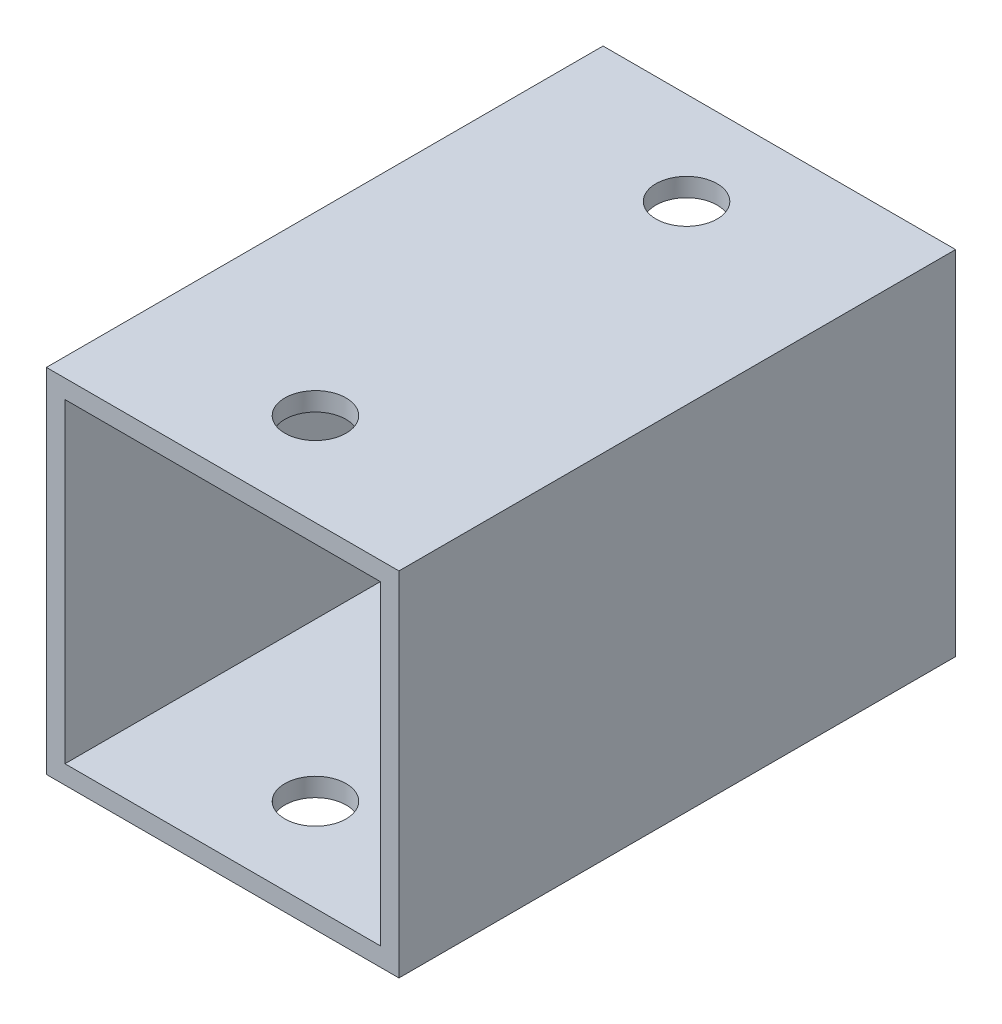
ISO-10303-21;
HEADER;
FILE_DESCRIPTION(('STEP AP214'),'2;1');
FILE_NAME('part.step','',(''),(''),'','','');
FILE_SCHEMA(('AUTOMOTIVE_DESIGN { 1 0 10303 214 1 1 1 1 }'));
ENDSEC;
DATA;
#1=APPLICATION_CONTEXT('core data for automotive mechanical design processes');
#2=APPLICATION_PROTOCOL_DEFINITION('international standard','automotive_design',2000,#1);
#3=PRODUCT_CONTEXT('',#1,'mechanical');
#4=PRODUCT('Part','Part','',(#3));
#5=PRODUCT_RELATED_PRODUCT_CATEGORY('part','',(#4));
#6=PRODUCT_DEFINITION_FORMATION('','',#4);
#7=PRODUCT_DEFINITION_CONTEXT('part definition',#1,'design');
#8=PRODUCT_DEFINITION('design','',#6,#7);
#9=PRODUCT_DEFINITION_SHAPE('','',#8);
#10=(LENGTH_UNIT() NAMED_UNIT(*) SI_UNIT(.MILLI.,.METRE.));
#11=(NAMED_UNIT(*) PLANE_ANGLE_UNIT() SI_UNIT($,.RADIAN.));
#12=(NAMED_UNIT(*) SI_UNIT($,.STERADIAN.) SOLID_ANGLE_UNIT());
#13=UNCERTAINTY_MEASURE_WITH_UNIT(LENGTH_MEASURE(1.E-05),#10,'distance_accuracy_value','');
#14=(GEOMETRIC_REPRESENTATION_CONTEXT(3) GLOBAL_UNCERTAINTY_ASSIGNED_CONTEXT((#13)) GLOBAL_UNIT_ASSIGNED_CONTEXT((#10,
#11,#12)) REPRESENTATION_CONTEXT('',''));
#15=CARTESIAN_POINT('',(0.,0.,0.));
#16=DIRECTION('',(0.,0.,1.));
#17=DIRECTION('',(1.,0.,0.));
#18=AXIS2_PLACEMENT_3D('',#15,#16,#17);
#19=CARTESIAN_POINT('',(0.,0.,30.));
#20=DIRECTION('',(0.,0.,-1.));
#21=DIRECTION('',(-1.,0.,0.));
#22=AXIS2_PLACEMENT_3D('',#19,#20,#21);
#23=PLANE('',#22);
#24=DIRECTION('',(0.,-1.,0.));
#25=VECTOR('',#24,1.);
#26=CARTESIAN_POINT('',(0.,0.,30.));
#27=LINE('',#26,#25);
#28=CARTESIAN_POINT('',(0.,19.,30.));
#29=VERTEX_POINT('',#28);
#30=CARTESIAN_POINT('',(0.,0.,30.));
#31=VERTEX_POINT('',#30);
#32=EDGE_CURVE('E132',#29,#31,#27,.T.);
#33=ORIENTED_EDGE('',*,*,#32,.T.);
#34=DIRECTION('',(1.,0.,0.));
#35=VECTOR('',#34,1.);
#36=CARTESIAN_POINT('',(0.,0.,30.));
#37=LINE('',#36,#35);
#38=CARTESIAN_POINT('',(19.,0.,30.));
#39=VERTEX_POINT('',#38);
#40=EDGE_CURVE('E135',#31,#39,#37,.T.);
#41=ORIENTED_EDGE('',*,*,#40,.T.);
#42=DIRECTION('',(0.,1.,0.));
#43=VECTOR('',#42,1.);
#44=CARTESIAN_POINT('',(19.,0.,30.));
#45=LINE('',#44,#43);
#46=CARTESIAN_POINT('',(19.,19.,30.));
#47=VERTEX_POINT('',#46);
#48=EDGE_CURVE('E138',#39,#47,#45,.T.);
#49=ORIENTED_EDGE('',*,*,#48,.T.);
#50=DIRECTION('',(-1.,0.,0.));
#51=VECTOR('',#50,1.);
#52=CARTESIAN_POINT('',(0.,19.,30.));
#53=LINE('',#52,#51);
#54=EDGE_CURVE('E140',#47,#29,#53,.T.);
#55=ORIENTED_EDGE('',*,*,#54,.T.);
#56=EDGE_LOOP('',(#33,#41,#49,#55));
#57=FACE_BOUND('',#56,.T.);
#58=DIRECTION('',(0.,-1.,0.));
#59=VECTOR('',#58,1.);
#60=CARTESIAN_POINT('',(1.,0.,30.));
#61=LINE('',#60,#59);
#62=CARTESIAN_POINT('',(1.,18.,30.));
#63=VERTEX_POINT('',#62);
#64=CARTESIAN_POINT('',(1.,1.,30.));
#65=VERTEX_POINT('',#64);
#66=EDGE_CURVE('E120',#63,#65,#61,.T.);
#67=ORIENTED_EDGE('',*,*,#66,.F.);
#68=DIRECTION('',(-1.,0.,0.));
#69=VECTOR('',#68,1.);
#70=CARTESIAN_POINT('',(0.,18.,30.));
#71=LINE('',#70,#69);
#72=CARTESIAN_POINT('',(18.,18.,30.));
#73=VERTEX_POINT('',#72);
#74=EDGE_CURVE('E104',#73,#63,#71,.T.);
#75=ORIENTED_EDGE('',*,*,#74,.F.);
#76=DIRECTION('',(0.,1.,0.));
#77=VECTOR('',#76,1.);
#78=CARTESIAN_POINT('',(18.,0.,30.));
#79=LINE('',#78,#77);
#80=CARTESIAN_POINT('',(18.,1.,30.));
#81=VERTEX_POINT('',#80);
#82=EDGE_CURVE('E129',#81,#73,#79,.T.);
#83=ORIENTED_EDGE('',*,*,#82,.F.);
#84=DIRECTION('',(1.,0.,0.));
#85=VECTOR('',#84,1.);
#86=CARTESIAN_POINT('',(0.,1.,30.));
#87=LINE('',#86,#85);
#88=EDGE_CURVE('E122',#65,#81,#87,.T.);
#89=ORIENTED_EDGE('',*,*,#88,.F.);
#90=EDGE_LOOP('',(#67,#75,#83,#89));
#91=FACE_BOUND('',#90,.T.);
#92=ADVANCED_FACE('F32',(#57,#91),#23,.F.);
#93=CARTESIAN_POINT('',(0.,0.,0.));
#94=DIRECTION('',(0.,0.,-1.));
#95=DIRECTION('',(-1.,0.,0.));
#96=AXIS2_PLACEMENT_3D('',#93,#94,#95);
#97=PLANE('',#96);
#98=DIRECTION('',(0.,-1.,0.));
#99=VECTOR('',#98,1.);
#100=CARTESIAN_POINT('',(0.,0.,0.));
#101=LINE('',#100,#99);
#102=CARTESIAN_POINT('',(0.,19.,0.));
#103=VERTEX_POINT('',#102);
#104=CARTESIAN_POINT('',(0.,0.,0.));
#105=VERTEX_POINT('',#104);
#106=EDGE_CURVE('E143',#103,#105,#101,.T.);
#107=ORIENTED_EDGE('',*,*,#106,.F.);
#108=DIRECTION('',(-1.,0.,0.));
#109=VECTOR('',#108,1.);
#110=CARTESIAN_POINT('',(0.,19.,0.));
#111=LINE('',#110,#109);
#112=CARTESIAN_POINT('',(19.,19.,0.));
#113=VERTEX_POINT('',#112);
#114=EDGE_CURVE('E136',#113,#103,#111,.T.);
#115=ORIENTED_EDGE('',*,*,#114,.F.);
#116=DIRECTION('',(0.,1.,0.));
#117=VECTOR('',#116,1.);
#118=CARTESIAN_POINT('',(19.,0.,0.));
#119=LINE('',#118,#117);
#120=CARTESIAN_POINT('',(19.,0.,0.));
#121=VERTEX_POINT('',#120);
#122=EDGE_CURVE('E148',#121,#113,#119,.T.);
#123=ORIENTED_EDGE('',*,*,#122,.F.);
#124=DIRECTION('',(1.,0.,0.));
#125=VECTOR('',#124,1.);
#126=CARTESIAN_POINT('',(0.,0.,0.));
#127=LINE('',#126,#125);
#128=EDGE_CURVE('E146',#105,#121,#127,.T.);
#129=ORIENTED_EDGE('',*,*,#128,.F.);
#130=EDGE_LOOP('',(#107,#115,#123,#129));
#131=FACE_BOUND('',#130,.T.);
#132=DIRECTION('',(-1.,0.,0.));
#133=VECTOR('',#132,1.);
#134=CARTESIAN_POINT('',(0.,18.,0.));
#135=LINE('',#134,#133);
#136=CARTESIAN_POINT('',(18.,18.,0.));
#137=VERTEX_POINT('',#136);
#138=CARTESIAN_POINT('',(1.,18.,0.));
#139=VERTEX_POINT('',#138);
#140=EDGE_CURVE('E102',#137,#139,#135,.T.);
#141=ORIENTED_EDGE('',*,*,#140,.T.);
#142=DIRECTION('',(0.,-1.,0.));
#143=VECTOR('',#142,1.);
#144=CARTESIAN_POINT('',(1.,0.,0.));
#145=LINE('',#144,#143);
#146=CARTESIAN_POINT('',(1.,1.,0.));
#147=VERTEX_POINT('',#146);
#148=EDGE_CURVE('E110',#139,#147,#145,.T.);
#149=ORIENTED_EDGE('',*,*,#148,.T.);
#150=DIRECTION('',(1.,0.,0.));
#151=VECTOR('',#150,1.);
#152=CARTESIAN_POINT('',(0.,1.,0.));
#153=LINE('',#152,#151);
#154=CARTESIAN_POINT('',(18.,1.,0.));
#155=VERTEX_POINT('',#154);
#156=EDGE_CURVE('E116',#147,#155,#153,.T.);
#157=ORIENTED_EDGE('',*,*,#156,.T.);
#158=DIRECTION('',(0.,1.,0.));
#159=VECTOR('',#158,1.);
#160=CARTESIAN_POINT('',(18.,0.,0.));
#161=LINE('',#160,#159);
#162=EDGE_CURVE('E56',#155,#137,#161,.T.);
#163=ORIENTED_EDGE('',*,*,#162,.T.);
#164=EDGE_LOOP('',(#141,#149,#157,#163));
#165=FACE_BOUND('',#164,.T.);
#166=ADVANCED_FACE('F119',(#131,#165),#97,.T.);
#167=CARTESIAN_POINT('',(0.,0.,30.));
#168=DIRECTION('',(1.,0.,0.));
#169=DIRECTION('',(0.,0.,-1.));
#170=AXIS2_PLACEMENT_3D('',#167,#168,#169);
#171=PLANE('',#170);
#172=ORIENTED_EDGE('',*,*,#106,.T.);
#173=DIRECTION('',(0.,0.,-1.));
#174=VECTOR('',#173,1.);
#175=CARTESIAN_POINT('',(0.,0.,30.));
#176=LINE('',#175,#174);
#177=EDGE_CURVE('E11',#31,#105,#176,.T.);
#178=ORIENTED_EDGE('',*,*,#177,.F.);
#179=ORIENTED_EDGE('',*,*,#32,.F.);
#180=DIRECTION('',(0.,0.,-1.));
#181=VECTOR('',#180,1.);
#182=CARTESIAN_POINT('',(0.,19.,30.));
#183=LINE('',#182,#181);
#184=EDGE_CURVE('E142',#29,#103,#183,.T.);
#185=ORIENTED_EDGE('',*,*,#184,.T.);
#186=EDGE_LOOP('',(#172,#178,#179,#185));
#187=FACE_BOUND('',#186,.T.);
#188=ADVANCED_FACE('F34',(#187),#171,.F.);
#189=CARTESIAN_POINT('',(0.,0.,30.));
#190=DIRECTION('',(0.,1.,0.));
#191=DIRECTION('',(0.,0.,1.));
#192=AXIS2_PLACEMENT_3D('',#189,#190,#191);
#193=PLANE('',#192);
#194=CARTESIAN_POINT('',(9.5,0.,5.));
#195=DIRECTION('',(0.,1.,0.));
#196=DIRECTION('',(0.,0.,1.));
#197=AXIS2_PLACEMENT_3D('',#194,#195,#196);
#198=CIRCLE('',#197,1.65);
#199=CARTESIAN_POINT('',(9.5,0.,6.65));
#200=VERTEX_POINT('',#199);
#201=EDGE_CURVE('E160',#200,#200,#198,.T.);
#202=ORIENTED_EDGE('',*,*,#201,.T.);
#203=EDGE_LOOP('',(#202));
#204=FACE_BOUND('',#203,.T.);
#205=CARTESIAN_POINT('',(9.5,0.,25.));
#206=DIRECTION('',(0.,1.,0.));
#207=DIRECTION('',(0.,0.,1.));
#208=AXIS2_PLACEMENT_3D('',#205,#206,#207);
#209=CIRCLE('',#208,1.65);
#210=CARTESIAN_POINT('',(9.5,0.,26.65));
#211=VERTEX_POINT('',#210);
#212=EDGE_CURVE('E176',#211,#211,#209,.T.);
#213=ORIENTED_EDGE('',*,*,#212,.T.);
#214=EDGE_LOOP('',(#213));
#215=FACE_BOUND('',#214,.T.);
#216=ORIENTED_EDGE('',*,*,#128,.T.);
#217=DIRECTION('',(0.,0.,-1.));
#218=VECTOR('',#217,1.);
#219=CARTESIAN_POINT('',(19.,0.,30.));
#220=LINE('',#219,#218);
#221=EDGE_CURVE('E41',#39,#121,#220,.T.);
#222=ORIENTED_EDGE('',*,*,#221,.F.);
#223=ORIENTED_EDGE('',*,*,#40,.F.);
#224=ORIENTED_EDGE('',*,*,#177,.T.);
#225=EDGE_LOOP('',(#216,#222,#223,#224));
#226=FACE_BOUND('',#225,.T.);
#227=ADVANCED_FACE('F216',(#204,#215,#226),#193,.F.);
#228=CARTESIAN_POINT('',(19.,0.,30.));
#229=DIRECTION('',(-1.,0.,0.));
#230=DIRECTION('',(0.,0.,1.));
#231=AXIS2_PLACEMENT_3D('',#228,#229,#230);
#232=PLANE('',#231);
#233=ORIENTED_EDGE('',*,*,#122,.T.);
#234=DIRECTION('',(0.,0.,-1.));
#235=VECTOR('',#234,1.);
#236=CARTESIAN_POINT('',(19.,19.,30.));
#237=LINE('',#236,#235);
#238=EDGE_CURVE('E153',#47,#113,#237,.T.);
#239=ORIENTED_EDGE('',*,*,#238,.F.);
#240=ORIENTED_EDGE('',*,*,#48,.F.);
#241=ORIENTED_EDGE('',*,*,#221,.T.);
#242=EDGE_LOOP('',(#233,#239,#240,#241));
#243=FACE_BOUND('',#242,.T.);
#244=ADVANCED_FACE('F213',(#243),#232,.F.);
#245=CARTESIAN_POINT('',(0.,19.,30.));
#246=DIRECTION('',(0.,-1.,0.));
#247=DIRECTION('',(0.,0.,-1.));
#248=AXIS2_PLACEMENT_3D('',#245,#246,#247);
#249=PLANE('',#248);
#250=CARTESIAN_POINT('',(9.5,19.,5.));
#251=DIRECTION('',(0.,1.,0.));
#252=DIRECTION('',(0.,0.,1.));
#253=AXIS2_PLACEMENT_3D('',#250,#251,#252);
#254=CIRCLE('',#253,1.65);
#255=CARTESIAN_POINT('',(9.5,19.,6.65));
#256=VERTEX_POINT('',#255);
#257=EDGE_CURVE('E166',#256,#256,#254,.T.);
#258=ORIENTED_EDGE('',*,*,#257,.F.);
#259=EDGE_LOOP('',(#258));
#260=FACE_BOUND('',#259,.T.);
#261=CARTESIAN_POINT('',(9.5,19.,25.));
#262=DIRECTION('',(0.,1.,0.));
#263=DIRECTION('',(0.,0.,1.));
#264=AXIS2_PLACEMENT_3D('',#261,#262,#263);
#265=CIRCLE('',#264,1.65);
#266=CARTESIAN_POINT('',(9.5,19.,26.65));
#267=VERTEX_POINT('',#266);
#268=EDGE_CURVE('E171',#267,#267,#265,.T.);
#269=ORIENTED_EDGE('',*,*,#268,.F.);
#270=EDGE_LOOP('',(#269));
#271=FACE_BOUND('',#270,.T.);
#272=ORIENTED_EDGE('',*,*,#114,.T.);
#273=ORIENTED_EDGE('',*,*,#184,.F.);
#274=ORIENTED_EDGE('',*,*,#54,.F.);
#275=ORIENTED_EDGE('',*,*,#238,.T.);
#276=EDGE_LOOP('',(#272,#273,#274,#275));
#277=FACE_BOUND('',#276,.T.);
#278=ADVANCED_FACE('F197',(#260,#271,#277),#249,.F.);
#279=CARTESIAN_POINT('',(1.,0.,30.));
#280=DIRECTION('',(1.,0.,0.));
#281=DIRECTION('',(0.,0.,-1.));
#282=AXIS2_PLACEMENT_3D('',#279,#280,#281);
#283=PLANE('',#282);
#284=ORIENTED_EDGE('',*,*,#148,.F.);
#285=DIRECTION('',(0.,0.,-1.));
#286=VECTOR('',#285,1.);
#287=CARTESIAN_POINT('',(1.,18.,30.));
#288=LINE('',#287,#286);
#289=EDGE_CURVE('E98',#63,#139,#288,.T.);
#290=ORIENTED_EDGE('',*,*,#289,.F.);
#291=ORIENTED_EDGE('',*,*,#66,.T.);
#292=DIRECTION('',(0.,0.,-1.));
#293=VECTOR('',#292,1.);
#294=CARTESIAN_POINT('',(1.,1.,30.));
#295=LINE('',#294,#293);
#296=EDGE_CURVE('E113',#65,#147,#295,.T.);
#297=ORIENTED_EDGE('',*,*,#296,.T.);
#298=EDGE_LOOP('',(#284,#290,#291,#297));
#299=FACE_BOUND('',#298,.T.);
#300=ADVANCED_FACE('F111',(#299),#283,.T.);
#301=CARTESIAN_POINT('',(0.,1.,30.));
#302=DIRECTION('',(0.,1.,0.));
#303=DIRECTION('',(0.,0.,1.));
#304=AXIS2_PLACEMENT_3D('',#301,#302,#303);
#305=PLANE('',#304);
#306=CARTESIAN_POINT('',(9.5,1.,5.));
#307=DIRECTION('',(0.,1.,0.));
#308=DIRECTION('',(0.,0.,1.));
#309=AXIS2_PLACEMENT_3D('',#306,#307,#308);
#310=CIRCLE('',#309,1.65);
#311=CARTESIAN_POINT('',(9.5,1.,6.65));
#312=VERTEX_POINT('',#311);
#313=EDGE_CURVE('E117',#312,#312,#310,.T.);
#314=ORIENTED_EDGE('',*,*,#313,.F.);
#315=EDGE_LOOP('',(#314));
#316=FACE_BOUND('',#315,.T.);
#317=CARTESIAN_POINT('',(9.5,1.,25.));
#318=DIRECTION('',(0.,1.,0.));
#319=DIRECTION('',(0.,0.,1.));
#320=AXIS2_PLACEMENT_3D('',#317,#318,#319);
#321=CIRCLE('',#320,1.65);
#322=CARTESIAN_POINT('',(9.5,1.,26.65));
#323=VERTEX_POINT('',#322);
#324=EDGE_CURVE('E159',#323,#323,#321,.T.);
#325=ORIENTED_EDGE('',*,*,#324,.F.);
#326=EDGE_LOOP('',(#325));
#327=FACE_BOUND('',#326,.T.);
#328=ORIENTED_EDGE('',*,*,#156,.F.);
#329=ORIENTED_EDGE('',*,*,#296,.F.);
#330=ORIENTED_EDGE('',*,*,#88,.T.);
#331=DIRECTION('',(0.,0.,-1.));
#332=VECTOR('',#331,1.);
#333=CARTESIAN_POINT('',(18.,1.,30.));
#334=LINE('',#333,#332);
#335=EDGE_CURVE('E181',#81,#155,#334,.T.);
#336=ORIENTED_EDGE('',*,*,#335,.T.);
#337=EDGE_LOOP('',(#328,#329,#330,#336));
#338=FACE_BOUND('',#337,.T.);
#339=ADVANCED_FACE('F188',(#316,#327,#338),#305,.T.);
#340=CARTESIAN_POINT('',(18.,0.,30.));
#341=DIRECTION('',(-1.,0.,0.));
#342=DIRECTION('',(0.,0.,1.));
#343=AXIS2_PLACEMENT_3D('',#340,#341,#342);
#344=PLANE('',#343);
#345=ORIENTED_EDGE('',*,*,#162,.F.);
#346=ORIENTED_EDGE('',*,*,#335,.F.);
#347=ORIENTED_EDGE('',*,*,#82,.T.);
#348=DIRECTION('',(0.,0.,-1.));
#349=VECTOR('',#348,1.);
#350=CARTESIAN_POINT('',(18.,18.,30.));
#351=LINE('',#350,#349);
#352=EDGE_CURVE('E49',#73,#137,#351,.T.);
#353=ORIENTED_EDGE('',*,*,#352,.T.);
#354=EDGE_LOOP('',(#345,#346,#347,#353));
#355=FACE_BOUND('',#354,.T.);
#356=ADVANCED_FACE('F183',(#355),#344,.T.);
#357=CARTESIAN_POINT('',(0.,18.,30.));
#358=DIRECTION('',(0.,-1.,0.));
#359=DIRECTION('',(0.,0.,-1.));
#360=AXIS2_PLACEMENT_3D('',#357,#358,#359);
#361=PLANE('',#360);
#362=CARTESIAN_POINT('',(9.5,18.,5.));
#363=DIRECTION('',(0.,-1.,0.));
#364=DIRECTION('',(0.,0.,-1.));
#365=AXIS2_PLACEMENT_3D('',#362,#363,#364);
#366=CIRCLE('',#365,1.65);
#367=CARTESIAN_POINT('',(9.5,18.,3.35));
#368=VERTEX_POINT('',#367);
#369=EDGE_CURVE('E36',#368,#368,#366,.T.);
#370=ORIENTED_EDGE('',*,*,#369,.F.);
#371=EDGE_LOOP('',(#370));
#372=FACE_BOUND('',#371,.T.);
#373=CARTESIAN_POINT('',(9.5,18.,25.));
#374=DIRECTION('',(0.,-1.,0.));
#375=DIRECTION('',(0.,0.,-1.));
#376=AXIS2_PLACEMENT_3D('',#373,#374,#375);
#377=CIRCLE('',#376,1.65);
#378=CARTESIAN_POINT('',(9.5,18.,23.35));
#379=VERTEX_POINT('',#378);
#380=EDGE_CURVE('E157',#379,#379,#377,.T.);
#381=ORIENTED_EDGE('',*,*,#380,.F.);
#382=EDGE_LOOP('',(#381));
#383=FACE_BOUND('',#382,.T.);
#384=ORIENTED_EDGE('',*,*,#140,.F.);
#385=ORIENTED_EDGE('',*,*,#352,.F.);
#386=ORIENTED_EDGE('',*,*,#74,.T.);
#387=ORIENTED_EDGE('',*,*,#289,.T.);
#388=EDGE_LOOP('',(#384,#385,#386,#387));
#389=FACE_BOUND('',#388,.T.);
#390=ADVANCED_FACE('F100',(#372,#383,#389),#361,.T.);
#391=CARTESIAN_POINT('',(9.5,0.,25.));
#392=DIRECTION('',(0.,1.,0.));
#393=DIRECTION('',(0.,0.,1.));
#394=AXIS2_PLACEMENT_3D('',#391,#392,#393);
#395=CYLINDRICAL_SURFACE('',#394,1.65);
#396=ORIENTED_EDGE('',*,*,#380,.T.);
#397=EDGE_LOOP('',(#396));
#398=FACE_BOUND('',#397,.T.);
#399=ORIENTED_EDGE('',*,*,#268,.T.);
#400=EDGE_LOOP('',(#399));
#401=FACE_BOUND('',#400,.T.);
#402=ADVANCED_FACE('F244',(#398,#401),#395,.F.);
#403=CARTESIAN_POINT('',(9.5,0.,5.));
#404=DIRECTION('',(0.,1.,0.));
#405=DIRECTION('',(0.,0.,1.));
#406=AXIS2_PLACEMENT_3D('',#403,#404,#405);
#407=CYLINDRICAL_SURFACE('',#406,1.65);
#408=ORIENTED_EDGE('',*,*,#369,.T.);
#409=EDGE_LOOP('',(#408));
#410=FACE_BOUND('',#409,.T.);
#411=ORIENTED_EDGE('',*,*,#257,.T.);
#412=EDGE_LOOP('',(#411));
#413=FACE_BOUND('',#412,.T.);
#414=ADVANCED_FACE('F241',(#410,#413),#407,.F.);
#415=ORIENTED_EDGE('',*,*,#324,.T.);
#416=EDGE_LOOP('',(#415));
#417=FACE_BOUND('',#416,.T.);
#418=ORIENTED_EDGE('',*,*,#212,.F.);
#419=EDGE_LOOP('',(#418));
#420=FACE_BOUND('',#419,.T.);
#421=ADVANCED_FACE('F238',(#417,#420),#395,.F.);
#422=ORIENTED_EDGE('',*,*,#313,.T.);
#423=EDGE_LOOP('',(#422));
#424=FACE_BOUND('',#423,.T.);
#425=ORIENTED_EDGE('',*,*,#201,.F.);
#426=EDGE_LOOP('',(#425));
#427=FACE_BOUND('',#426,.T.);
#428=ADVANCED_FACE('F240',(#424,#427),#407,.F.);
#429=CLOSED_SHELL('',(#92,#166,#188,#227,#244,#278,#300,#339,#356,#390,#402,#414,#421,#428));
#430=MANIFOLD_SOLID_BREP('B2',#429);
#431=ADVANCED_BREP_SHAPE_REPRESENTATION('',(#18,#430),#14);
#432=SHAPE_DEFINITION_REPRESENTATION(#9,#431);
ENDSEC;
END-ISO-10303-21;
